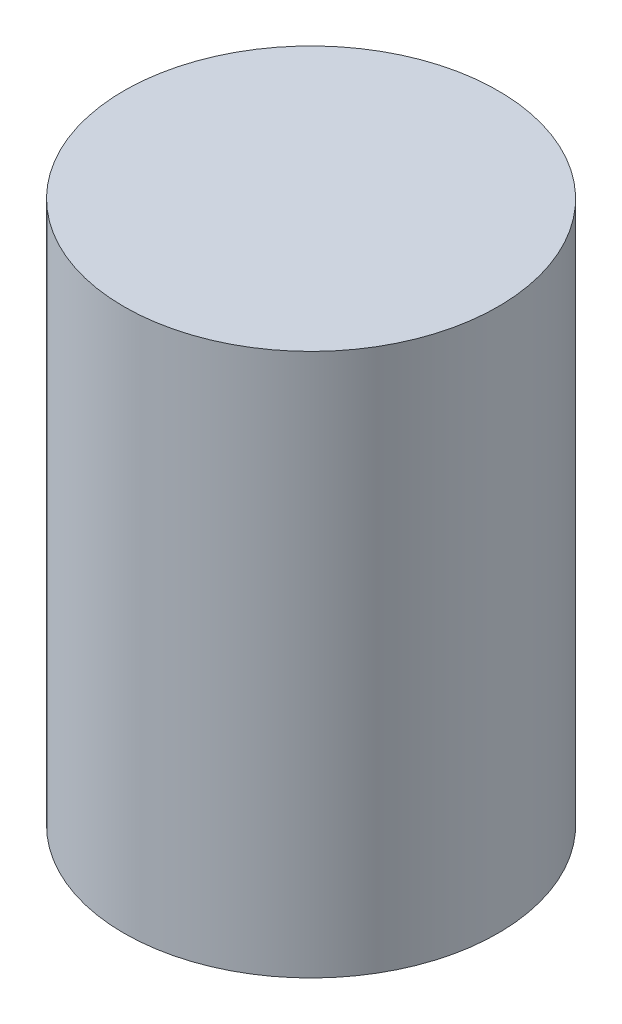
ISO-10303-21;
HEADER;
FILE_DESCRIPTION(('STEP AP214'),'2;1');
FILE_NAME('part.step','',(''),(''),'','','');
FILE_SCHEMA(('AUTOMOTIVE_DESIGN { 1 0 10303 214 1 1 1 1 }'));
ENDSEC;
DATA;
#1=APPLICATION_CONTEXT('core data for automotive mechanical design processes');
#2=APPLICATION_PROTOCOL_DEFINITION('international standard','automotive_design',2000,#1);
#3=PRODUCT_CONTEXT('',#1,'mechanical');
#4=PRODUCT('Part','Part','',(#3));
#5=PRODUCT_RELATED_PRODUCT_CATEGORY('part','',(#4));
#6=PRODUCT_DEFINITION_FORMATION('','',#4);
#7=PRODUCT_DEFINITION_CONTEXT('part definition',#1,'design');
#8=PRODUCT_DEFINITION('design','',#6,#7);
#9=PRODUCT_DEFINITION_SHAPE('','',#8);
#10=(LENGTH_UNIT() NAMED_UNIT(*) SI_UNIT(.MILLI.,.METRE.));
#11=(NAMED_UNIT(*) PLANE_ANGLE_UNIT() SI_UNIT($,.RADIAN.));
#12=(NAMED_UNIT(*) SI_UNIT($,.STERADIAN.) SOLID_ANGLE_UNIT());
#13=UNCERTAINTY_MEASURE_WITH_UNIT(LENGTH_MEASURE(1.E-05),#10,'distance_accuracy_value','');
#14=(GEOMETRIC_REPRESENTATION_CONTEXT(3) GLOBAL_UNCERTAINTY_ASSIGNED_CONTEXT((#13)) GLOBAL_UNIT_ASSIGNED_CONTEXT((#10,
#11,#12)) REPRESENTATION_CONTEXT('',''));
#15=CARTESIAN_POINT('',(0.,0.,0.));
#16=DIRECTION('',(0.,0.,1.));
#17=DIRECTION('',(1.,0.,0.));
#18=AXIS2_PLACEMENT_3D('',#15,#16,#17);
#19=CARTESIAN_POINT('',(0.,90.,0.));
#20=DIRECTION('',(0.,-1.,0.));
#21=DIRECTION('',(0.,0.,-1.));
#22=AXIS2_PLACEMENT_3D('',#19,#20,#21);
#23=CYLINDRICAL_SURFACE('',#22,31.0287833333335);
#24=CARTESIAN_POINT('',(0.,90.,0.));
#25=DIRECTION('',(0.,1.,0.));
#26=DIRECTION('',(0.,0.,1.));
#27=AXIS2_PLACEMENT_3D('',#24,#25,#26);
#28=CIRCLE('',#27,31.0287833333335);
#29=CARTESIAN_POINT('',(0.,90.,31.0287833333335));
#30=VERTEX_POINT('',#29);
#31=EDGE_CURVE('E10',#30,#30,#28,.T.);
#32=ORIENTED_EDGE('',*,*,#31,.F.);
#33=EDGE_LOOP('',(#32));
#34=FACE_BOUND('',#33,.T.);
#35=CARTESIAN_POINT('',(0.,0.,0.));
#36=DIRECTION('',(0.,1.,0.));
#37=DIRECTION('',(0.,0.,1.));
#38=AXIS2_PLACEMENT_3D('',#35,#36,#37);
#39=CIRCLE('',#38,31.0287833333335);
#40=CARTESIAN_POINT('',(0.,0.,31.0287833333335));
#41=VERTEX_POINT('',#40);
#42=EDGE_CURVE('E41',#41,#41,#39,.T.);
#43=ORIENTED_EDGE('',*,*,#42,.T.);
#44=EDGE_LOOP('',(#43));
#45=FACE_BOUND('',#44,.T.);
#46=ADVANCED_FACE('F38',(#34,#45),#23,.T.);
#47=CARTESIAN_POINT('',(0.,90.,0.));
#48=DIRECTION('',(0.,1.,0.));
#49=DIRECTION('',(0.,0.,1.));
#50=AXIS2_PLACEMENT_3D('',#47,#48,#49);
#51=PLANE('',#50);
#52=ORIENTED_EDGE('',*,*,#31,.T.);
#53=EDGE_LOOP('',(#52));
#54=FACE_BOUND('',#53,.T.);
#55=ADVANCED_FACE('F68',(#54),#51,.T.);
#56=CARTESIAN_POINT('',(0.,0.,0.));
#57=DIRECTION('',(0.,1.,0.));
#58=DIRECTION('',(0.,0.,1.));
#59=AXIS2_PLACEMENT_3D('',#56,#57,#58);
#60=PLANE('',#59);
#61=CARTESIAN_POINT('',(0.,0.,0.));
#62=DIRECTION('',(0.,1.,0.));
#63=DIRECTION('',(0.,0.,1.));
#64=AXIS2_PLACEMENT_3D('',#61,#62,#63);
#65=CIRCLE('',#64,26.0287833333335);
#66=CARTESIAN_POINT('',(0.,0.,26.0287833333335));
#67=VERTEX_POINT('',#66);
#68=EDGE_CURVE('E50',#67,#67,#65,.T.);
#69=ORIENTED_EDGE('',*,*,#68,.T.);
#70=EDGE_LOOP('',(#69));
#71=FACE_BOUND('',#70,.T.);
#72=ORIENTED_EDGE('',*,*,#42,.F.);
#73=EDGE_LOOP('',(#72));
#74=FACE_BOUND('',#73,.T.);
#75=ADVANCED_FACE('F65',(#71,#74),#60,.F.);
#76=CARTESIAN_POINT('',(0.,85.,0.));
#77=DIRECTION('',(0.,-1.,0.));
#78=DIRECTION('',(0.,0.,-1.));
#79=AXIS2_PLACEMENT_3D('',#76,#77,#78);
#80=CYLINDRICAL_SURFACE('',#79,26.0287833333335);
#81=CARTESIAN_POINT('',(0.,85.,0.));
#82=DIRECTION('',(0.,1.,0.));
#83=DIRECTION('',(0.,0.,1.));
#84=AXIS2_PLACEMENT_3D('',#81,#82,#83);
#85=CIRCLE('',#84,26.0287833333335);
#86=CARTESIAN_POINT('',(0.,85.,26.0287833333335));
#87=VERTEX_POINT('',#86);
#88=EDGE_CURVE('E48',#87,#87,#85,.T.);
#89=ORIENTED_EDGE('',*,*,#88,.T.);
#90=EDGE_LOOP('',(#89));
#91=FACE_BOUND('',#90,.T.);
#92=ORIENTED_EDGE('',*,*,#68,.F.);
#93=EDGE_LOOP('',(#92));
#94=FACE_BOUND('',#93,.T.);
#95=ADVANCED_FACE('F56',(#91,#94),#80,.F.);
#96=CARTESIAN_POINT('',(0.,85.,0.));
#97=DIRECTION('',(0.,1.,0.));
#98=DIRECTION('',(0.,0.,1.));
#99=AXIS2_PLACEMENT_3D('',#96,#97,#98);
#100=PLANE('',#99);
#101=ORIENTED_EDGE('',*,*,#88,.F.);
#102=EDGE_LOOP('',(#101));
#103=FACE_BOUND('',#102,.T.);
#104=ADVANCED_FACE('F59',(#103),#100,.F.);
#105=CLOSED_SHELL('',(#46,#55,#75,#95,#104));
#106=MANIFOLD_SOLID_BREP('B2',#105);
#107=ADVANCED_BREP_SHAPE_REPRESENTATION('',(#18,#106),#14);
#108=SHAPE_DEFINITION_REPRESENTATION(#9,#107);
ENDSEC;
END-ISO-10303-21;
